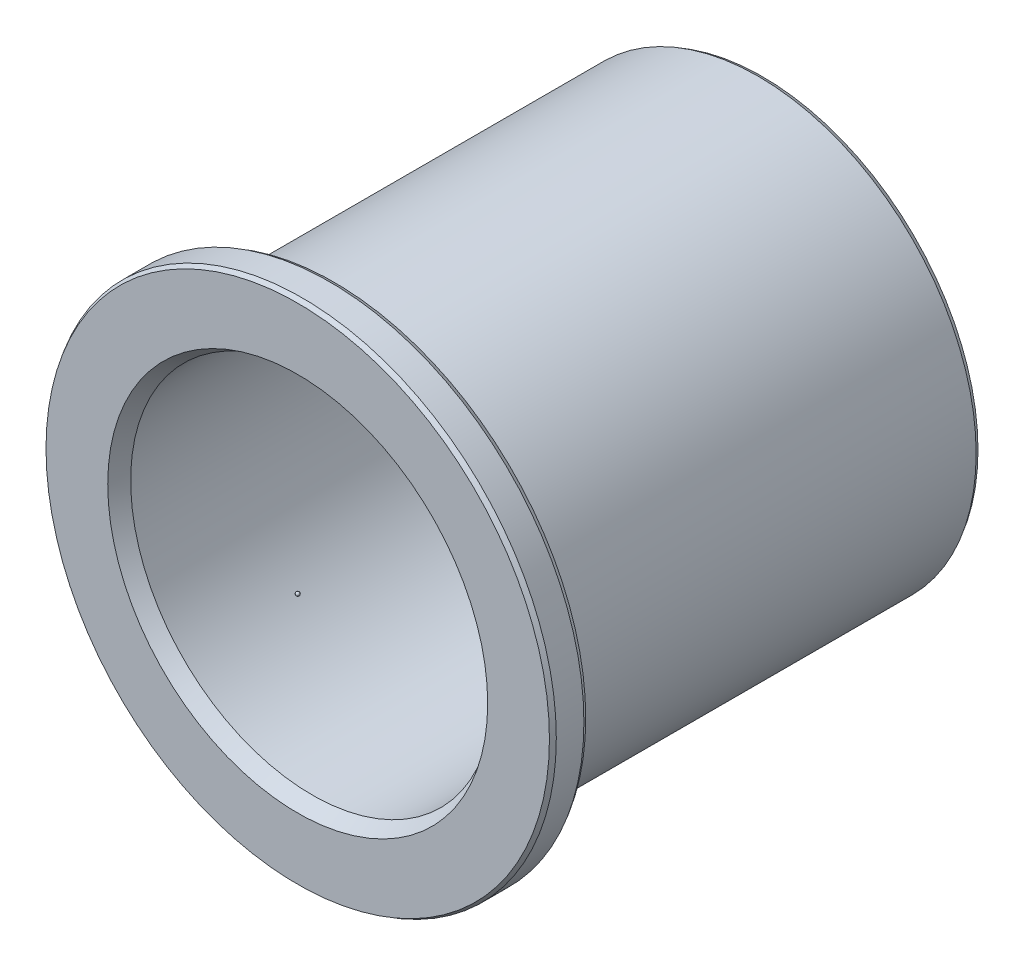
ISO-10303-21;
HEADER;
FILE_DESCRIPTION(('STEP AP214'),'2;1');
FILE_NAME('part.step','',(''),(''),'','','');
FILE_SCHEMA(('AUTOMOTIVE_DESIGN { 1 0 10303 214 1 1 1 1 }'));
ENDSEC;
DATA;
#1=APPLICATION_CONTEXT('core data for automotive mechanical design processes');
#2=APPLICATION_PROTOCOL_DEFINITION('international standard','automotive_design',2000,#1);
#3=PRODUCT_CONTEXT('',#1,'mechanical');
#4=PRODUCT('Part','Part','',(#3));
#5=PRODUCT_RELATED_PRODUCT_CATEGORY('part','',(#4));
#6=PRODUCT_DEFINITION_FORMATION('','',#4);
#7=PRODUCT_DEFINITION_CONTEXT('part definition',#1,'design');
#8=PRODUCT_DEFINITION('design','',#6,#7);
#9=PRODUCT_DEFINITION_SHAPE('','',#8);
#10=(LENGTH_UNIT() NAMED_UNIT(*) SI_UNIT(.MILLI.,.METRE.));
#11=(NAMED_UNIT(*) PLANE_ANGLE_UNIT() SI_UNIT($,.RADIAN.));
#12=(NAMED_UNIT(*) SI_UNIT($,.STERADIAN.) SOLID_ANGLE_UNIT());
#13=UNCERTAINTY_MEASURE_WITH_UNIT(LENGTH_MEASURE(1.E-05),#10,'distance_accuracy_value','');
#14=(GEOMETRIC_REPRESENTATION_CONTEXT(3) GLOBAL_UNCERTAINTY_ASSIGNED_CONTEXT((#13)) GLOBAL_UNIT_ASSIGNED_CONTEXT((#10,
#11,#12)) REPRESENTATION_CONTEXT('',''));
#15=CARTESIAN_POINT('',(0.,0.,0.));
#16=DIRECTION('',(0.,0.,1.));
#17=DIRECTION('',(1.,0.,0.));
#18=AXIS2_PLACEMENT_3D('',#15,#16,#17);
#19=CARTESIAN_POINT('',(0.,0.,0.));
#20=DIRECTION('',(0.,0.,-1.));
#21=DIRECTION('',(1.,0.,0.));
#22=AXIS2_PLACEMENT_3D('',#19,#20,#21);
#23=SPHERICAL_SURFACE('',#22,0.125);
#24=CARTESIAN_POINT('',(0.,0.,-0.125));
#25=VERTEX_POINT('',#24);
#26=VERTEX_LOOP('',#25);
#27=FACE_BOUND('',#26,.T.);
#28=ADVANCED_FACE('F45',(#27),#23,.T.);
#29=CLOSED_SHELL('',(#28));
#30=MANIFOLD_SOLID_BREP('B2',#29);
#31=CARTESIAN_POINT('',(0.,0.,32.));
#32=DIRECTION('',(0.,0.,-1.));
#33=DIRECTION('',(1.,0.,0.));
#34=AXIS2_PLACEMENT_3D('',#31,#32,#33);
#35=SPHERICAL_SURFACE('',#34,0.125);
#36=CARTESIAN_POINT('',(0.,0.,31.875));
#37=VERTEX_POINT('',#36);
#38=VERTEX_LOOP('',#37);
#39=FACE_BOUND('',#38,.T.);
#40=ADVANCED_FACE('F68',(#39),#35,.T.);
#41=CLOSED_SHELL('',(#40));
#42=MANIFOLD_SOLID_BREP('B6',#41);
#43=CARTESIAN_POINT('',(0.,0.,32.));
#44=DIRECTION('',(0.,0.,-1.));
#45=DIRECTION('',(-1.,0.,0.));
#46=AXIS2_PLACEMENT_3D('',#43,#44,#45);
#47=CYLINDRICAL_SURFACE('',#46,15.);
#48=CARTESIAN_POINT('',(0.,0.,0.300000000000002));
#49=DIRECTION('',(0.,0.,1.));
#50=DIRECTION('',(1.,0.,0.));
#51=AXIS2_PLACEMENT_3D('',#48,#49,#50);
#52=CIRCLE('',#51,15.);
#53=CARTESIAN_POINT('',(15.,0.,0.300000000000002));
#54=VERTEX_POINT('',#53);
#55=EDGE_CURVE('E95',#54,#54,#52,.T.);
#56=ORIENTED_EDGE('',*,*,#55,.T.);
#57=EDGE_LOOP('',(#56));
#58=FACE_BOUND('',#57,.T.);
#59=CARTESIAN_POINT('',(0.,0.,29.5));
#60=DIRECTION('',(0.,0.,1.));
#61=DIRECTION('',(1.,0.,0.));
#62=AXIS2_PLACEMENT_3D('',#59,#60,#61);
#63=CIRCLE('',#62,15.);
#64=CARTESIAN_POINT('',(15.,0.,29.5));
#65=VERTEX_POINT('',#64);
#66=EDGE_CURVE('E122',#65,#65,#63,.T.);
#67=ORIENTED_EDGE('',*,*,#66,.F.);
#68=EDGE_LOOP('',(#67));
#69=FACE_BOUND('',#68,.T.);
#70=ADVANCED_FACE('F84',(#58,#69),#47,.T.);
#71=CARTESIAN_POINT('',(0.,0.,32.));
#72=DIRECTION('',(0.,0.,1.));
#73=DIRECTION('',(1.,0.,0.));
#74=AXIS2_PLACEMENT_3D('',#71,#72,#73);
#75=PLANE('',#74);
#76=CARTESIAN_POINT('',(0.,0.,32.));
#77=DIRECTION('',(0.,0.,1.));
#78=DIRECTION('',(1.,0.,0.));
#79=AXIS2_PLACEMENT_3D('',#76,#77,#78);
#80=CIRCLE('',#79,17.3267949192431);
#81=CARTESIAN_POINT('',(17.3267949192431,0.,32.));
#82=VERTEX_POINT('',#81);
#83=EDGE_CURVE('E107',#82,#82,#80,.T.);
#84=ORIENTED_EDGE('',*,*,#83,.T.);
#85=EDGE_LOOP('',(#84));
#86=FACE_BOUND('',#85,.T.);
#87=CARTESIAN_POINT('',(0.,0.,32.));
#88=DIRECTION('',(0.,0.,1.));
#89=DIRECTION('',(1.,0.,0.));
#90=AXIS2_PLACEMENT_3D('',#87,#88,#89);
#91=CIRCLE('',#90,13.0773502691896);
#92=CARTESIAN_POINT('',(13.0773502691896,0.,32.));
#93=VERTEX_POINT('',#92);
#94=EDGE_CURVE('E113',#93,#93,#91,.F.);
#95=ORIENTED_EDGE('',*,*,#94,.T.);
#96=EDGE_LOOP('',(#95));
#97=FACE_BOUND('',#96,.T.);
#98=ADVANCED_FACE('F129',(#86,#97),#75,.T.);
#99=CARTESIAN_POINT('',(0.,0.,0.));
#100=DIRECTION('',(0.,0.,1.));
#101=DIRECTION('',(1.,0.,0.));
#102=AXIS2_PLACEMENT_3D('',#99,#100,#101);
#103=PLANE('',#102);
#104=CARTESIAN_POINT('',(0.,0.,0.));
#105=DIRECTION('',(0.,0.,1.));
#106=DIRECTION('',(1.,0.,0.));
#107=AXIS2_PLACEMENT_3D('',#104,#105,#106);
#108=CIRCLE('',#107,14.8267949192431);
#109=CARTESIAN_POINT('',(14.8267949192431,0.,0.));
#110=VERTEX_POINT('',#109);
#111=EDGE_CURVE('E91',#110,#110,#108,.F.);
#112=ORIENTED_EDGE('',*,*,#111,.T.);
#113=EDGE_LOOP('',(#112));
#114=FACE_BOUND('',#113,.T.);
#115=CARTESIAN_POINT('',(0.,0.,0.));
#116=DIRECTION('',(0.,0.,1.));
#117=DIRECTION('',(1.,0.,0.));
#118=AXIS2_PLACEMENT_3D('',#115,#116,#117);
#119=CIRCLE('',#118,13.0773502691896);
#120=CARTESIAN_POINT('',(13.0773502691896,0.,0.));
#121=VERTEX_POINT('',#120);
#122=EDGE_CURVE('E110',#121,#121,#119,.T.);
#123=ORIENTED_EDGE('',*,*,#122,.T.);
#124=EDGE_LOOP('',(#123));
#125=FACE_BOUND('',#124,.T.);
#126=ADVANCED_FACE('F135',(#114,#125),#103,.F.);
#127=CARTESIAN_POINT('',(0.,0.,32.));
#128=DIRECTION('',(0.,0.,-1.));
#129=DIRECTION('',(-1.,0.,0.));
#130=AXIS2_PLACEMENT_3D('',#127,#128,#129);
#131=CYLINDRICAL_SURFACE('',#130,12.5);
#132=CARTESIAN_POINT('',(0.,0.,31.));
#133=DIRECTION('',(0.,0.,1.));
#134=DIRECTION('',(1.,0.,0.));
#135=AXIS2_PLACEMENT_3D('',#132,#133,#134);
#136=CIRCLE('',#135,12.5);
#137=CARTESIAN_POINT('',(12.5,0.,31.));
#138=VERTEX_POINT('',#137);
#139=EDGE_CURVE('E116',#138,#138,#136,.T.);
#140=ORIENTED_EDGE('',*,*,#139,.T.);
#141=EDGE_LOOP('',(#140));
#142=FACE_BOUND('',#141,.T.);
#143=CARTESIAN_POINT('',(0.,0.,1.));
#144=DIRECTION('',(0.,0.,1.));
#145=DIRECTION('',(1.,0.,0.));
#146=AXIS2_PLACEMENT_3D('',#143,#144,#145);
#147=CIRCLE('',#146,12.5);
#148=CARTESIAN_POINT('',(12.5,0.,1.));
#149=VERTEX_POINT('',#148);
#150=EDGE_CURVE('E119',#149,#149,#147,.F.);
#151=ORIENTED_EDGE('',*,*,#150,.T.);
#152=EDGE_LOOP('',(#151));
#153=FACE_BOUND('',#152,.T.);
#154=ADVANCED_FACE('F172',(#142,#153),#131,.F.);
#155=CARTESIAN_POINT('',(0.,0.,29.5));
#156=DIRECTION('',(0.,0.,1.));
#157=DIRECTION('',(1.,0.,0.));
#158=AXIS2_PLACEMENT_3D('',#155,#156,#157);
#159=PLANE('',#158);
#160=CARTESIAN_POINT('',(0.,0.,29.5));
#161=DIRECTION('',(0.,0.,1.));
#162=DIRECTION('',(1.,0.,0.));
#163=AXIS2_PLACEMENT_3D('',#160,#161,#162);
#164=CIRCLE('',#163,17.3267949192431);
#165=CARTESIAN_POINT('',(17.3267949192431,0.,29.5));
#166=VERTEX_POINT('',#165);
#167=EDGE_CURVE('E67',#166,#166,#164,.F.);
#168=ORIENTED_EDGE('',*,*,#167,.T.);
#169=EDGE_LOOP('',(#168));
#170=FACE_BOUND('',#169,.T.);
#171=ORIENTED_EDGE('',*,*,#66,.T.);
#172=EDGE_LOOP('',(#171));
#173=FACE_BOUND('',#172,.T.);
#174=ADVANCED_FACE('F126',(#170,#173),#159,.F.);
#175=CARTESIAN_POINT('',(0.,0.,29.5));
#176=DIRECTION('',(0.,0.,1.));
#177=DIRECTION('',(1.,0.,0.));
#178=AXIS2_PLACEMENT_3D('',#175,#176,#177);
#179=CYLINDRICAL_SURFACE('',#178,17.5);
#180=CARTESIAN_POINT('',(0.,0.,31.7));
#181=DIRECTION('',(0.,0.,1.));
#182=DIRECTION('',(1.,0.,0.));
#183=AXIS2_PLACEMENT_3D('',#180,#181,#182);
#184=CIRCLE('',#183,17.5);
#185=CARTESIAN_POINT('',(17.5,0.,31.7));
#186=VERTEX_POINT('',#185);
#187=EDGE_CURVE('E99',#186,#186,#184,.F.);
#188=ORIENTED_EDGE('',*,*,#187,.T.);
#189=EDGE_LOOP('',(#188));
#190=FACE_BOUND('',#189,.T.);
#191=CARTESIAN_POINT('',(0.,0.,29.8));
#192=DIRECTION('',(0.,0.,1.));
#193=DIRECTION('',(1.,0.,0.));
#194=AXIS2_PLACEMENT_3D('',#191,#192,#193);
#195=CIRCLE('',#194,17.5);
#196=CARTESIAN_POINT('',(17.5,0.,29.8));
#197=VERTEX_POINT('',#196);
#198=EDGE_CURVE('E104',#197,#197,#195,.T.);
#199=ORIENTED_EDGE('',*,*,#198,.T.);
#200=EDGE_LOOP('',(#199));
#201=FACE_BOUND('',#200,.T.);
#202=ADVANCED_FACE('F144',(#190,#201),#179,.T.);
#203=CARTESIAN_POINT('',(0.,0.,31.));
#204=DIRECTION('',(0.,0.,1.));
#205=DIRECTION('',(1.,0.,0.));
#206=AXIS2_PLACEMENT_3D('',#203,#204,#205);
#207=CONICAL_SURFACE('',#206,12.5,0.523598775598305);
#208=ORIENTED_EDGE('',*,*,#94,.F.);
#209=EDGE_LOOP('',(#208));
#210=FACE_BOUND('',#209,.T.);
#211=ORIENTED_EDGE('',*,*,#139,.F.);
#212=EDGE_LOOP('',(#211));
#213=FACE_BOUND('',#212,.T.);
#214=ADVANCED_FACE('F140',(#210,#213),#207,.F.);
#215=CARTESIAN_POINT('',(0.,0.,0.));
#216=DIRECTION('',(0.,0.,-1.));
#217=DIRECTION('',(-1.,0.,0.));
#218=AXIS2_PLACEMENT_3D('',#215,#216,#217);
#219=CONICAL_SURFACE('',#218,13.0773502691896,0.523598775598305);
#220=ORIENTED_EDGE('',*,*,#150,.F.);
#221=EDGE_LOOP('',(#220));
#222=FACE_BOUND('',#221,.T.);
#223=ORIENTED_EDGE('',*,*,#122,.F.);
#224=EDGE_LOOP('',(#223));
#225=FACE_BOUND('',#224,.T.);
#226=ADVANCED_FACE('F143',(#222,#225),#219,.F.);
#227=CARTESIAN_POINT('',(0.,0.,32.));
#228=DIRECTION('',(0.,0.,-1.));
#229=DIRECTION('',(-1.,0.,0.));
#230=AXIS2_PLACEMENT_3D('',#227,#228,#229);
#231=CONICAL_SURFACE('',#230,17.3267949192431,0.523598775598302);
#232=ORIENTED_EDGE('',*,*,#187,.F.);
#233=EDGE_LOOP('',(#232));
#234=FACE_BOUND('',#233,.T.);
#235=ORIENTED_EDGE('',*,*,#83,.F.);
#236=EDGE_LOOP('',(#235));
#237=FACE_BOUND('',#236,.T.);
#238=ADVANCED_FACE('F148',(#234,#237),#231,.T.);
#239=CARTESIAN_POINT('',(0.,0.,0.300000000000002));
#240=DIRECTION('',(0.,0.,1.));
#241=DIRECTION('',(1.,0.,0.));
#242=AXIS2_PLACEMENT_3D('',#239,#240,#241);
#243=CONICAL_SURFACE('',#242,15.,0.523598775598306);
#244=ORIENTED_EDGE('',*,*,#111,.F.);
#245=EDGE_LOOP('',(#244));
#246=FACE_BOUND('',#245,.T.);
#247=ORIENTED_EDGE('',*,*,#55,.F.);
#248=EDGE_LOOP('',(#247));
#249=FACE_BOUND('',#248,.T.);
#250=ADVANCED_FACE('F151',(#246,#249),#243,.T.);
#251=CARTESIAN_POINT('',(0.,0.,29.8));
#252=DIRECTION('',(0.,0.,1.));
#253=DIRECTION('',(1.,0.,0.));
#254=AXIS2_PLACEMENT_3D('',#251,#252,#253);
#255=CONICAL_SURFACE('',#254,17.5,0.523598775598302);
#256=ORIENTED_EDGE('',*,*,#167,.F.);
#257=EDGE_LOOP('',(#256));
#258=FACE_BOUND('',#257,.T.);
#259=ORIENTED_EDGE('',*,*,#198,.F.);
#260=EDGE_LOOP('',(#259));
#261=FACE_BOUND('',#260,.T.);
#262=ADVANCED_FACE('F86',(#258,#261),#255,.T.);
#263=CLOSED_SHELL('',(#70,#98,#126,#154,#174,#202,#214,#226,#238,#250,#262));
#264=MANIFOLD_SOLID_BREP('B41',#263);
#265=ADVANCED_BREP_SHAPE_REPRESENTATION('',(#18,#30,#42,#264),#14);
#266=SHAPE_DEFINITION_REPRESENTATION(#9,#265);
ENDSEC;
END-ISO-10303-21;
